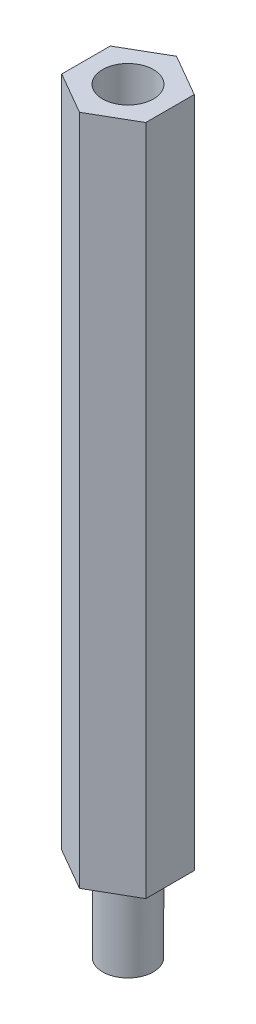
ISO-10303-21;
HEADER;
FILE_DESCRIPTION(('STEP AP214'),'2;1');
FILE_NAME('part.step','',(''),(''),'','','');
FILE_SCHEMA(('AUTOMOTIVE_DESIGN { 1 0 10303 214 1 1 1 1 }'));
ENDSEC;
DATA;
#1=APPLICATION_CONTEXT('core data for automotive mechanical design processes');
#2=APPLICATION_PROTOCOL_DEFINITION('international standard','automotive_design',2000,#1);
#3=PRODUCT_CONTEXT('',#1,'mechanical');
#4=PRODUCT('Part','Part','',(#3));
#5=PRODUCT_RELATED_PRODUCT_CATEGORY('part','',(#4));
#6=PRODUCT_DEFINITION_FORMATION('','',#4);
#7=PRODUCT_DEFINITION_CONTEXT('part definition',#1,'design');
#8=PRODUCT_DEFINITION('design','',#6,#7);
#9=PRODUCT_DEFINITION_SHAPE('','',#8);
#10=(LENGTH_UNIT() NAMED_UNIT(*) SI_UNIT(.MILLI.,.METRE.));
#11=(NAMED_UNIT(*) PLANE_ANGLE_UNIT() SI_UNIT($,.RADIAN.));
#12=(NAMED_UNIT(*) SI_UNIT($,.STERADIAN.) SOLID_ANGLE_UNIT());
#13=UNCERTAINTY_MEASURE_WITH_UNIT(LENGTH_MEASURE(1.E-05),#10,'distance_accuracy_value','');
#14=(GEOMETRIC_REPRESENTATION_CONTEXT(3) GLOBAL_UNCERTAINTY_ASSIGNED_CONTEXT((#13)) GLOBAL_UNIT_ASSIGNED_CONTEXT((#10,
#11,#12)) REPRESENTATION_CONTEXT('',''));
#15=CARTESIAN_POINT('',(0.,0.,0.));
#16=DIRECTION('',(0.,0.,1.));
#17=DIRECTION('',(1.,0.,0.));
#18=AXIS2_PLACEMENT_3D('',#15,#16,#17);
#19=CARTESIAN_POINT('',(-2.50000000000002,40.,1.44337567297408));
#20=DIRECTION('',(0.5,0.,-0.866025403784439));
#21=DIRECTION('',(-0.866025403784439,0.,-0.5));
#22=AXIS2_PLACEMENT_3D('',#19,#20,#21);
#23=PLANE('',#22);
#24=DIRECTION('',(0.866025403784439,0.,0.5));
#25=VECTOR('',#24,1.);
#26=CARTESIAN_POINT('',(-2.50000000000002,0.,1.44337567297408));
#27=LINE('',#26,#25);
#28=CARTESIAN_POINT('',(-2.50000000000002,0.,1.44337567297408));
#29=VERTEX_POINT('',#28);
#30=CARTESIAN_POINT('',(0.,0.,2.88675134594815));
#31=VERTEX_POINT('',#30);
#32=EDGE_CURVE('E122',#29,#31,#27,.T.);
#33=ORIENTED_EDGE('',*,*,#32,.T.);
#34=DIRECTION('',(0.,-1.,0.));
#35=VECTOR('',#34,1.);
#36=CARTESIAN_POINT('',(0.,40.,2.88675134594815));
#37=LINE('',#36,#35);
#38=CARTESIAN_POINT('',(0.,40.,2.88675134594815));
#39=VERTEX_POINT('',#38);
#40=EDGE_CURVE('E45',#39,#31,#37,.T.);
#41=ORIENTED_EDGE('',*,*,#40,.F.);
#42=DIRECTION('',(0.866025403784439,0.,0.5));
#43=VECTOR('',#42,1.);
#44=CARTESIAN_POINT('',(-2.50000000000002,40.,1.44337567297408));
#45=LINE('',#44,#43);
#46=CARTESIAN_POINT('',(-2.50000000000002,40.,1.44337567297408));
#47=VERTEX_POINT('',#46);
#48=EDGE_CURVE('E133',#47,#39,#45,.T.);
#49=ORIENTED_EDGE('',*,*,#48,.F.);
#50=DIRECTION('',(0.,-1.,0.));
#51=VECTOR('',#50,1.);
#52=CARTESIAN_POINT('',(-2.50000000000002,40.,1.44337567297408));
#53=LINE('',#52,#51);
#54=EDGE_CURVE('E118',#47,#29,#53,.T.);
#55=ORIENTED_EDGE('',*,*,#54,.T.);
#56=EDGE_LOOP('',(#33,#41,#49,#55));
#57=FACE_BOUND('',#56,.T.);
#58=ADVANCED_FACE('F37',(#57),#23,.F.);
#59=CARTESIAN_POINT('',(0.,40.,2.88675134594815));
#60=DIRECTION('',(-0.499999999999999,0.,-0.866025403784439));
#61=DIRECTION('',(-0.866025403784439,0.,0.499999999999999));
#62=AXIS2_PLACEMENT_3D('',#59,#60,#61);
#63=PLANE('',#62);
#64=DIRECTION('',(0.866025403784439,0.,-0.499999999999999));
#65=VECTOR('',#64,1.);
#66=CARTESIAN_POINT('',(0.,0.,2.88675134594815));
#67=LINE('',#66,#65);
#68=CARTESIAN_POINT('',(2.50000000000002,0.,1.44337567297408));
#69=VERTEX_POINT('',#68);
#70=EDGE_CURVE('E125',#31,#69,#67,.T.);
#71=ORIENTED_EDGE('',*,*,#70,.T.);
#72=DIRECTION('',(0.,-1.,0.));
#73=VECTOR('',#72,1.);
#74=CARTESIAN_POINT('',(2.50000000000002,40.,1.44337567297408));
#75=LINE('',#74,#73);
#76=CARTESIAN_POINT('',(2.50000000000002,40.,1.44337567297408));
#77=VERTEX_POINT('',#76);
#78=EDGE_CURVE('E137',#77,#69,#75,.T.);
#79=ORIENTED_EDGE('',*,*,#78,.F.);
#80=DIRECTION('',(0.866025403784439,0.,-0.499999999999999));
#81=VECTOR('',#80,1.);
#82=CARTESIAN_POINT('',(0.,40.,2.88675134594815));
#83=LINE('',#82,#81);
#84=EDGE_CURVE('E91',#39,#77,#83,.T.);
#85=ORIENTED_EDGE('',*,*,#84,.F.);
#86=ORIENTED_EDGE('',*,*,#40,.T.);
#87=EDGE_LOOP('',(#71,#79,#85,#86));
#88=FACE_BOUND('',#87,.T.);
#89=ADVANCED_FACE('F140',(#88),#63,.F.);
#90=CARTESIAN_POINT('',(2.50000000000002,40.,1.44337567297408));
#91=DIRECTION('',(-1.,0.,0.));
#92=DIRECTION('',(0.,0.,1.));
#93=AXIS2_PLACEMENT_3D('',#90,#91,#92);
#94=PLANE('',#93);
#95=DIRECTION('',(0.,0.,-1.));
#96=VECTOR('',#95,1.);
#97=CARTESIAN_POINT('',(2.50000000000002,0.,1.44337567297408));
#98=LINE('',#97,#96);
#99=CARTESIAN_POINT('',(2.50000000000002,0.,-1.44337567297408));
#100=VERTEX_POINT('',#99);
#101=EDGE_CURVE('E128',#69,#100,#98,.T.);
#102=ORIENTED_EDGE('',*,*,#101,.T.);
#103=DIRECTION('',(0.,-1.,0.));
#104=VECTOR('',#103,1.);
#105=CARTESIAN_POINT('',(2.50000000000002,40.,-1.44337567297408));
#106=LINE('',#105,#104);
#107=CARTESIAN_POINT('',(2.50000000000002,40.,-1.44337567297408));
#108=VERTEX_POINT('',#107);
#109=EDGE_CURVE('E113',#108,#100,#106,.T.);
#110=ORIENTED_EDGE('',*,*,#109,.F.);
#111=DIRECTION('',(0.,0.,-1.));
#112=VECTOR('',#111,1.);
#113=CARTESIAN_POINT('',(2.50000000000002,40.,1.44337567297408));
#114=LINE('',#113,#112);
#115=EDGE_CURVE('E104',#77,#108,#114,.T.);
#116=ORIENTED_EDGE('',*,*,#115,.F.);
#117=ORIENTED_EDGE('',*,*,#78,.T.);
#118=EDGE_LOOP('',(#102,#110,#116,#117));
#119=FACE_BOUND('',#118,.T.);
#120=ADVANCED_FACE('F148',(#119),#94,.F.);
#121=CARTESIAN_POINT('',(2.50000000000002,40.,-1.44337567297408));
#122=DIRECTION('',(-0.5,0.,0.866025403784439));
#123=DIRECTION('',(0.866025403784439,0.,0.5));
#124=AXIS2_PLACEMENT_3D('',#121,#122,#123);
#125=PLANE('',#124);
#126=DIRECTION('',(-0.866025403784439,0.,-0.5));
#127=VECTOR('',#126,1.);
#128=CARTESIAN_POINT('',(2.50000000000002,0.,-1.44337567297408));
#129=LINE('',#128,#127);
#130=CARTESIAN_POINT('',(0.,0.,-2.88675134594816));
#131=VERTEX_POINT('',#130);
#132=EDGE_CURVE('E112',#100,#131,#129,.T.);
#133=ORIENTED_EDGE('',*,*,#132,.T.);
#134=DIRECTION('',(0.,-1.,0.));
#135=VECTOR('',#134,1.);
#136=CARTESIAN_POINT('',(0.,40.,-2.88675134594816));
#137=LINE('',#136,#135);
#138=CARTESIAN_POINT('',(0.,40.,-2.88675134594816));
#139=VERTEX_POINT('',#138);
#140=EDGE_CURVE('E109',#139,#131,#137,.T.);
#141=ORIENTED_EDGE('',*,*,#140,.F.);
#142=DIRECTION('',(-0.866025403784439,0.,-0.5));
#143=VECTOR('',#142,1.);
#144=CARTESIAN_POINT('',(2.50000000000002,40.,-1.44337567297408));
#145=LINE('',#144,#143);
#146=EDGE_CURVE('E98',#108,#139,#145,.T.);
#147=ORIENTED_EDGE('',*,*,#146,.F.);
#148=ORIENTED_EDGE('',*,*,#109,.T.);
#149=EDGE_LOOP('',(#133,#141,#147,#148));
#150=FACE_BOUND('',#149,.T.);
#151=ADVANCED_FACE('F110',(#150),#125,.F.);
#152=CARTESIAN_POINT('',(0.,40.,-2.88675134594816));
#153=DIRECTION('',(0.5,0.,0.866025403784439));
#154=DIRECTION('',(0.866025403784439,0.,-0.5));
#155=AXIS2_PLACEMENT_3D('',#152,#153,#154);
#156=PLANE('',#155);
#157=DIRECTION('',(-0.866025403784439,0.,0.5));
#158=VECTOR('',#157,1.);
#159=CARTESIAN_POINT('',(0.,0.,-2.88675134594816));
#160=LINE('',#159,#158);
#161=CARTESIAN_POINT('',(-2.50000000000002,0.,-1.44337567297408));
#162=VERTEX_POINT('',#161);
#163=EDGE_CURVE('E76',#131,#162,#160,.T.);
#164=ORIENTED_EDGE('',*,*,#163,.T.);
#165=DIRECTION('',(0.,-1.,0.));
#166=VECTOR('',#165,1.);
#167=CARTESIAN_POINT('',(-2.50000000000002,40.,-1.44337567297408));
#168=LINE('',#167,#166);
#169=CARTESIAN_POINT('',(-2.50000000000002,40.,-1.44337567297408));
#170=VERTEX_POINT('',#169);
#171=EDGE_CURVE('E114',#170,#162,#168,.T.);
#172=ORIENTED_EDGE('',*,*,#171,.F.);
#173=DIRECTION('',(-0.866025403784439,0.,0.5));
#174=VECTOR('',#173,1.);
#175=CARTESIAN_POINT('',(0.,40.,-2.88675134594816));
#176=LINE('',#175,#174);
#177=EDGE_CURVE('E102',#139,#170,#176,.T.);
#178=ORIENTED_EDGE('',*,*,#177,.F.);
#179=ORIENTED_EDGE('',*,*,#140,.T.);
#180=EDGE_LOOP('',(#164,#172,#178,#179));
#181=FACE_BOUND('',#180,.T.);
#182=ADVANCED_FACE('F116',(#181),#156,.F.);
#183=CARTESIAN_POINT('',(-2.50000000000002,40.,-1.44337567297408));
#184=DIRECTION('',(1.,0.,0.));
#185=DIRECTION('',(0.,0.,-1.));
#186=AXIS2_PLACEMENT_3D('',#183,#184,#185);
#187=PLANE('',#186);
#188=DIRECTION('',(0.,0.,1.));
#189=VECTOR('',#188,1.);
#190=CARTESIAN_POINT('',(-2.50000000000002,0.,-1.44337567297408));
#191=LINE('',#190,#189);
#192=EDGE_CURVE('E82',#162,#29,#191,.T.);
#193=ORIENTED_EDGE('',*,*,#192,.T.);
#194=ORIENTED_EDGE('',*,*,#54,.F.);
#195=DIRECTION('',(0.,0.,1.));
#196=VECTOR('',#195,1.);
#197=CARTESIAN_POINT('',(-2.50000000000002,40.,-1.44337567297408));
#198=LINE('',#197,#196);
#199=EDGE_CURVE('E53',#170,#47,#198,.T.);
#200=ORIENTED_EDGE('',*,*,#199,.F.);
#201=ORIENTED_EDGE('',*,*,#171,.T.);
#202=EDGE_LOOP('',(#193,#194,#200,#201));
#203=FACE_BOUND('',#202,.T.);
#204=ADVANCED_FACE('F179',(#203),#187,.F.);
#205=CARTESIAN_POINT('',(0.,40.,0.));
#206=DIRECTION('',(0.,1.,0.));
#207=DIRECTION('',(0.,0.,1.));
#208=AXIS2_PLACEMENT_3D('',#205,#206,#207);
#209=PLANE('',#208);
#210=CARTESIAN_POINT('',(0.,40.,0.));
#211=DIRECTION('',(0.,1.,0.));
#212=DIRECTION('',(0.,0.,1.));
#213=AXIS2_PLACEMENT_3D('',#210,#211,#212);
#214=CIRCLE('',#213,1.51610249304691);
#215=CARTESIAN_POINT('',(0.,40.,1.51610249304691));
#216=VERTEX_POINT('',#215);
#217=EDGE_CURVE('E152',#216,#216,#214,.T.);
#218=ORIENTED_EDGE('',*,*,#217,.F.);
#219=EDGE_LOOP('',(#218));
#220=FACE_BOUND('',#219,.T.);
#221=ORIENTED_EDGE('',*,*,#48,.T.);
#222=ORIENTED_EDGE('',*,*,#84,.T.);
#223=ORIENTED_EDGE('',*,*,#115,.T.);
#224=ORIENTED_EDGE('',*,*,#146,.T.);
#225=ORIENTED_EDGE('',*,*,#177,.T.);
#226=ORIENTED_EDGE('',*,*,#199,.T.);
#227=EDGE_LOOP('',(#221,#222,#223,#224,#225,#226));
#228=FACE_BOUND('',#227,.T.);
#229=ADVANCED_FACE('F100',(#220,#228),#209,.T.);
#230=CARTESIAN_POINT('',(0.,0.,0.));
#231=DIRECTION('',(0.,1.,0.));
#232=DIRECTION('',(0.,0.,1.));
#233=AXIS2_PLACEMENT_3D('',#230,#231,#232);
#234=PLANE('',#233);
#235=CARTESIAN_POINT('',(0.,0.,0.));
#236=DIRECTION('',(0.,1.,0.));
#237=DIRECTION('',(0.,0.,1.));
#238=AXIS2_PLACEMENT_3D('',#235,#236,#237);
#239=CIRCLE('',#238,1.50585590252469);
#240=CARTESIAN_POINT('',(0.,0.,1.50585590252469));
#241=VERTEX_POINT('',#240);
#242=EDGE_CURVE('E11',#241,#241,#239,.F.);
#243=ORIENTED_EDGE('',*,*,#242,.F.);
#244=EDGE_LOOP('',(#243));
#245=FACE_BOUND('',#244,.T.);
#246=ORIENTED_EDGE('',*,*,#32,.F.);
#247=ORIENTED_EDGE('',*,*,#192,.F.);
#248=ORIENTED_EDGE('',*,*,#163,.F.);
#249=ORIENTED_EDGE('',*,*,#132,.F.);
#250=ORIENTED_EDGE('',*,*,#101,.F.);
#251=ORIENTED_EDGE('',*,*,#70,.F.);
#252=EDGE_LOOP('',(#246,#247,#248,#249,#250,#251));
#253=FACE_BOUND('',#252,.T.);
#254=ADVANCED_FACE('F145',(#245,#253),#234,.F.);
#255=CARTESIAN_POINT('',(0.,30.,0.));
#256=DIRECTION('',(0.,1.,0.));
#257=DIRECTION('',(0.,0.,1.));
#258=AXIS2_PLACEMENT_3D('',#255,#256,#257);
#259=CYLINDRICAL_SURFACE('',#258,1.51610249304691);
#260=CARTESIAN_POINT('',(0.,30.,0.));
#261=DIRECTION('',(0.,1.,0.));
#262=DIRECTION('',(0.,0.,1.));
#263=AXIS2_PLACEMENT_3D('',#260,#261,#262);
#264=CIRCLE('',#263,1.51610249304691);
#265=CARTESIAN_POINT('',(0.,30.,1.51610249304691));
#266=VERTEX_POINT('',#265);
#267=EDGE_CURVE('E126',#266,#266,#264,.T.);
#268=ORIENTED_EDGE('',*,*,#267,.F.);
#269=EDGE_LOOP('',(#268));
#270=FACE_BOUND('',#269,.T.);
#271=ORIENTED_EDGE('',*,*,#217,.T.);
#272=EDGE_LOOP('',(#271));
#273=FACE_BOUND('',#272,.T.);
#274=ADVANCED_FACE('F171',(#270,#273),#259,.F.);
#275=CARTESIAN_POINT('',(0.,30.,0.));
#276=DIRECTION('',(0.,1.,0.));
#277=DIRECTION('',(0.,0.,1.));
#278=AXIS2_PLACEMENT_3D('',#275,#276,#277);
#279=PLANE('',#278);
#280=ORIENTED_EDGE('',*,*,#267,.T.);
#281=EDGE_LOOP('',(#280));
#282=FACE_BOUND('',#281,.T.);
#283=ADVANCED_FACE('F166',(#282),#279,.T.);
#284=CARTESIAN_POINT('',(0.,-5.,0.));
#285=DIRECTION('',(0.,1.,0.));
#286=DIRECTION('',(0.,0.,1.));
#287=AXIS2_PLACEMENT_3D('',#284,#285,#286);
#288=CYLINDRICAL_SURFACE('',#287,1.50585590252469);
#289=CARTESIAN_POINT('',(0.,-5.,0.));
#290=DIRECTION('',(0.,-1.,0.));
#291=DIRECTION('',(0.,0.,-1.));
#292=AXIS2_PLACEMENT_3D('',#289,#290,#291);
#293=CIRCLE('',#292,1.50585590252469);
#294=CARTESIAN_POINT('',(0.,-5.,-1.50585590252469));
#295=VERTEX_POINT('',#294);
#296=EDGE_CURVE('E155',#295,#295,#293,.T.);
#297=ORIENTED_EDGE('',*,*,#296,.F.);
#298=EDGE_LOOP('',(#297));
#299=FACE_BOUND('',#298,.T.);
#300=ORIENTED_EDGE('',*,*,#242,.T.);
#301=EDGE_LOOP('',(#300));
#302=FACE_BOUND('',#301,.T.);
#303=ADVANCED_FACE('F163',(#299,#302),#288,.T.);
#304=CARTESIAN_POINT('',(0.,-5.,0.));
#305=DIRECTION('',(0.,-1.,0.));
#306=DIRECTION('',(0.,0.,-1.));
#307=AXIS2_PLACEMENT_3D('',#304,#305,#306);
#308=PLANE('',#307);
#309=ORIENTED_EDGE('',*,*,#296,.T.);
#310=EDGE_LOOP('',(#309));
#311=FACE_BOUND('',#310,.T.);
#312=ADVANCED_FACE('F161',(#311),#308,.T.);
#313=CLOSED_SHELL('',(#58,#89,#120,#151,#182,#204,#229,#254,#274,#283,#303,#312));
#314=MANIFOLD_SOLID_BREP('B2',#313);
#315=ADVANCED_BREP_SHAPE_REPRESENTATION('',(#18,#314),#14);
#316=SHAPE_DEFINITION_REPRESENTATION(#9,#315);
ENDSEC;
END-ISO-10303-21;
